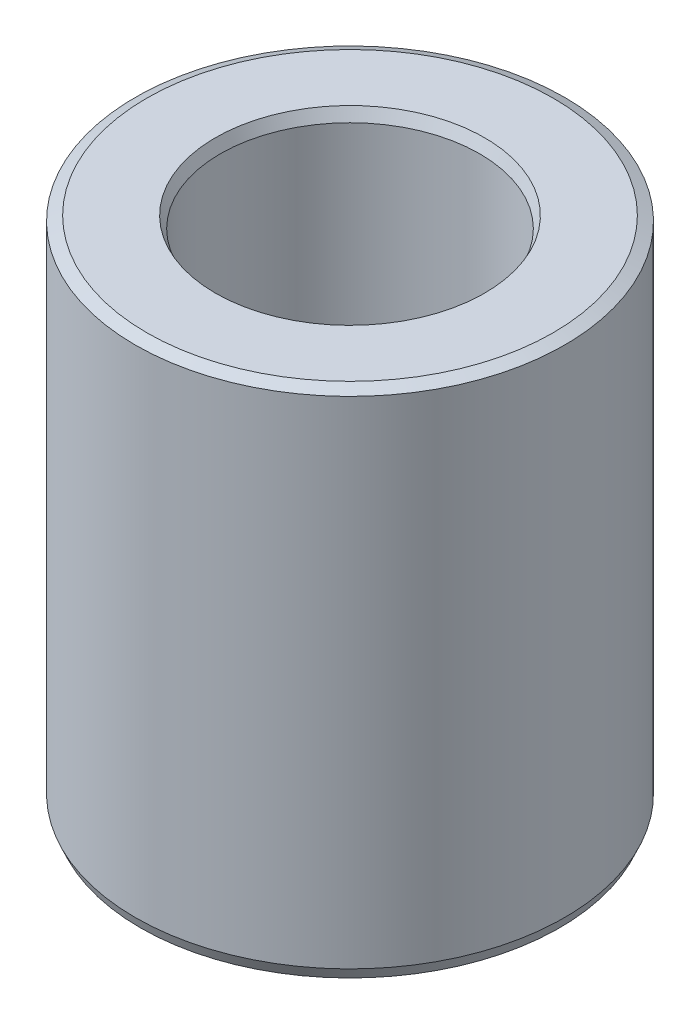
ISO-10303-21;
HEADER;
FILE_DESCRIPTION(('STEP AP214'),'2;1');
FILE_NAME('part.step','',(''),(''),'','','');
FILE_SCHEMA(('AUTOMOTIVE_DESIGN { 1 0 10303 214 1 1 1 1 }'));
ENDSEC;
DATA;
#1=APPLICATION_CONTEXT('core data for automotive mechanical design processes');
#2=APPLICATION_PROTOCOL_DEFINITION('international standard','automotive_design',2000,#1);
#3=PRODUCT_CONTEXT('',#1,'mechanical');
#4=PRODUCT('Part','Part','',(#3));
#5=PRODUCT_RELATED_PRODUCT_CATEGORY('part','',(#4));
#6=PRODUCT_DEFINITION_FORMATION('','',#4);
#7=PRODUCT_DEFINITION_CONTEXT('part definition',#1,'design');
#8=PRODUCT_DEFINITION('design','',#6,#7);
#9=PRODUCT_DEFINITION_SHAPE('','',#8);
#10=(LENGTH_UNIT() NAMED_UNIT(*) SI_UNIT(.MILLI.,.METRE.));
#11=(NAMED_UNIT(*) PLANE_ANGLE_UNIT() SI_UNIT($,.RADIAN.));
#12=(NAMED_UNIT(*) SI_UNIT($,.STERADIAN.) SOLID_ANGLE_UNIT());
#13=UNCERTAINTY_MEASURE_WITH_UNIT(LENGTH_MEASURE(1.E-05),#10,'distance_accuracy_value','');
#14=(GEOMETRIC_REPRESENTATION_CONTEXT(3) GLOBAL_UNCERTAINTY_ASSIGNED_CONTEXT((#13)) GLOBAL_UNIT_ASSIGNED_CONTEXT((#10,
#11,#12)) REPRESENTATION_CONTEXT('',''));
#15=CARTESIAN_POINT('',(0.,0.,0.));
#16=DIRECTION('',(0.,0.,1.));
#17=DIRECTION('',(1.,0.,0.));
#18=AXIS2_PLACEMENT_3D('',#15,#16,#17);
#19=CARTESIAN_POINT('',(0.,35.7987142283722,0.));
#20=DIRECTION('',(0.,-1.,0.));
#21=DIRECTION('',(0.,0.,-1.));
#22=AXIS2_PLACEMENT_3D('',#19,#20,#21);
#23=CYLINDRICAL_SURFACE('',#22,15.);
#24=CARTESIAN_POINT('',(0.,0.796052163354412,0.));
#25=DIRECTION('',(0.,1.,0.));
#26=DIRECTION('',(0.,0.,1.));
#27=AXIS2_PLACEMENT_3D('',#24,#25,#26);
#28=CIRCLE('',#27,15.);
#29=CARTESIAN_POINT('',(0.,0.796052163354412,15.));
#30=VERTEX_POINT('',#29);
#31=EDGE_CURVE('E10',#30,#30,#28,.T.);
#32=ORIENTED_EDGE('',*,*,#31,.T.);
#33=EDGE_LOOP('',(#32));
#34=FACE_BOUND('',#33,.T.);
#35=CARTESIAN_POINT('',(0.,35.4501099124994,0.));
#36=DIRECTION('',(0.,1.,0.));
#37=DIRECTION('',(0.,0.,1.));
#38=AXIS2_PLACEMENT_3D('',#35,#36,#37);
#39=CIRCLE('',#38,15.);
#40=CARTESIAN_POINT('',(0.,35.4501099124994,15.));
#41=VERTEX_POINT('',#40);
#42=EDGE_CURVE('E50',#41,#41,#39,.F.);
#43=ORIENTED_EDGE('',*,*,#42,.T.);
#44=EDGE_LOOP('',(#43));
#45=FACE_BOUND('',#44,.T.);
#46=ADVANCED_FACE('F39',(#34,#45),#23,.T.);
#47=CARTESIAN_POINT('',(0.,35.7987142283722,0.));
#48=DIRECTION('',(0.,1.,0.));
#49=DIRECTION('',(0.,0.,1.));
#50=AXIS2_PLACEMENT_3D('',#47,#48,#49);
#51=PLANE('',#50);
#52=CARTESIAN_POINT('',(0.,35.7987142283722,0.));
#53=DIRECTION('',(0.,1.,0.));
#54=DIRECTION('',(0.,0.,1.));
#55=AXIS2_PLACEMENT_3D('',#52,#53,#54);
#56=CIRCLE('',#55,9.41097797480665);
#57=CARTESIAN_POINT('',(0.,35.7987142283722,9.41097797480665));
#58=VERTEX_POINT('',#57);
#59=EDGE_CURVE('E58',#58,#58,#56,.F.);
#60=ORIENTED_EDGE('',*,*,#59,.T.);
#61=EDGE_LOOP('',(#60));
#62=FACE_BOUND('',#61,.T.);
#63=CARTESIAN_POINT('',(0.,35.7987142283722,0.));
#64=DIRECTION('',(0.,1.,0.));
#65=DIRECTION('',(0.,0.,1.));
#66=AXIS2_PLACEMENT_3D('',#63,#64,#65);
#67=CIRCLE('',#66,14.2039478366456);
#68=CARTESIAN_POINT('',(0.,35.7987142283722,14.2039478366456));
#69=VERTEX_POINT('',#68);
#70=EDGE_CURVE('E61',#69,#69,#67,.T.);
#71=ORIENTED_EDGE('',*,*,#70,.T.);
#72=EDGE_LOOP('',(#71));
#73=FACE_BOUND('',#72,.T.);
#74=ADVANCED_FACE('F88',(#62,#73),#51,.T.);
#75=CARTESIAN_POINT('',(0.,0.,0.));
#76=DIRECTION('',(0.,1.,0.));
#77=DIRECTION('',(0.,0.,1.));
#78=AXIS2_PLACEMENT_3D('',#75,#76,#77);
#79=PLANE('',#78);
#80=CARTESIAN_POINT('',(0.,0.,0.));
#81=DIRECTION('',(0.,1.,0.));
#82=DIRECTION('',(0.,0.,1.));
#83=AXIS2_PLACEMENT_3D('',#80,#81,#82);
#84=CIRCLE('',#83,9.85842582228821);
#85=CARTESIAN_POINT('',(0.,0.,9.85842582228821));
#86=VERTEX_POINT('',#85);
#87=EDGE_CURVE('E51',#86,#86,#84,.T.);
#88=ORIENTED_EDGE('',*,*,#87,.T.);
#89=EDGE_LOOP('',(#88));
#90=FACE_BOUND('',#89,.T.);
#91=CARTESIAN_POINT('',(0.,0.,0.));
#92=DIRECTION('',(0.,1.,0.));
#93=DIRECTION('',(0.,0.,1.));
#94=AXIS2_PLACEMENT_3D('',#91,#92,#93);
#95=CIRCLE('',#94,14.6513956841272);
#96=CARTESIAN_POINT('',(0.,0.,14.6513956841272));
#97=VERTEX_POINT('',#96);
#98=EDGE_CURVE('E54',#97,#97,#95,.F.);
#99=ORIENTED_EDGE('',*,*,#98,.T.);
#100=EDGE_LOOP('',(#99));
#101=FACE_BOUND('',#100,.T.);
#102=ADVANCED_FACE('F83',(#90,#101),#79,.F.);
#103=CARTESIAN_POINT('',(0.,35.7987142283722,0.));
#104=DIRECTION('',(0.,-1.,0.));
#105=DIRECTION('',(0.,0.,-1.));
#106=AXIS2_PLACEMENT_3D('',#103,#104,#105);
#107=CYLINDRICAL_SURFACE('',#106,9.06237365893382);
#108=CARTESIAN_POINT('',(0.,35.0026620650178,0.));
#109=DIRECTION('',(0.,1.,0.));
#110=DIRECTION('',(0.,0.,1.));
#111=AXIS2_PLACEMENT_3D('',#108,#109,#110);
#112=CIRCLE('',#111,9.06237365893382);
#113=CARTESIAN_POINT('',(0.,35.0026620650178,9.06237365893382));
#114=VERTEX_POINT('',#113);
#115=EDGE_CURVE('E67',#114,#114,#112,.T.);
#116=ORIENTED_EDGE('',*,*,#115,.T.);
#117=EDGE_LOOP('',(#116));
#118=FACE_BOUND('',#117,.T.);
#119=CARTESIAN_POINT('',(0.,0.34860431587283,0.));
#120=DIRECTION('',(0.,1.,0.));
#121=DIRECTION('',(0.,0.,1.));
#122=AXIS2_PLACEMENT_3D('',#119,#120,#121);
#123=CIRCLE('',#122,9.06237365893382);
#124=CARTESIAN_POINT('',(0.,0.34860431587283,9.06237365893382));
#125=VERTEX_POINT('',#124);
#126=EDGE_CURVE('E69',#125,#125,#123,.F.);
#127=ORIENTED_EDGE('',*,*,#126,.T.);
#128=EDGE_LOOP('',(#127));
#129=FACE_BOUND('',#128,.T.);
#130=ADVANCED_FACE('F71',(#118,#129),#107,.F.);
#131=CARTESIAN_POINT('',(0.,35.0026620650178,0.));
#132=DIRECTION('',(0.,1.,0.));
#133=DIRECTION('',(0.,0.,1.));
#134=AXIS2_PLACEMENT_3D('',#131,#132,#133);
#135=CONICAL_SURFACE('',#134,9.06237365893382,0.412759910373443);
#136=ORIENTED_EDGE('',*,*,#59,.F.);
#137=EDGE_LOOP('',(#136));
#138=FACE_BOUND('',#137,.T.);
#139=ORIENTED_EDGE('',*,*,#115,.F.);
#140=EDGE_LOOP('',(#139));
#141=FACE_BOUND('',#140,.T.);
#142=ADVANCED_FACE('F77',(#138,#141),#135,.F.);
#143=CARTESIAN_POINT('',(0.,0.,0.));
#144=DIRECTION('',(0.,-1.,0.));
#145=DIRECTION('',(0.,0.,-1.));
#146=AXIS2_PLACEMENT_3D('',#143,#144,#145);
#147=CONICAL_SURFACE('',#146,9.85842582228821,1.15803641642144);
#148=ORIENTED_EDGE('',*,*,#126,.F.);
#149=EDGE_LOOP('',(#148));
#150=FACE_BOUND('',#149,.T.);
#151=ORIENTED_EDGE('',*,*,#87,.F.);
#152=EDGE_LOOP('',(#151));
#153=FACE_BOUND('',#152,.T.);
#154=ADVANCED_FACE('F73',(#150,#153),#147,.F.);
#155=CARTESIAN_POINT('',(0.,0.796052163354412,0.));
#156=DIRECTION('',(0.,1.,0.));
#157=DIRECTION('',(0.,0.,1.));
#158=AXIS2_PLACEMENT_3D('',#155,#156,#157);
#159=CONICAL_SURFACE('',#158,15.,0.412759910373455);
#160=CARTESIAN_POINT('',(0.,0.,14.6513956841272));
#161=CARTESIAN_POINT('',(0.,0.00829221003494138,14.6550269790842));
#162=CARTESIAN_POINT('',(0.,0.0165844200698833,14.6586582740412));
#163=CARTESIAN_POINT('',(0.,0.033168840139767,14.6659208639552));
#164=CARTESIAN_POINT('',(0.,0.0414610501747089,14.6695521589122));
#165=CARTESIAN_POINT('',(0.,0.0580454702445925,14.6768147488262));
#166=CARTESIAN_POINT('',(0.,0.0663376802795343,14.6804460437832));
#167=CARTESIAN_POINT('',(0.,0.0829221003494177,14.6877086336972));
#168=CARTESIAN_POINT('',(0.,0.0912143103843594,14.6913399286543));
#169=CARTESIAN_POINT('',(0.,0.107798730454243,14.6986025185683));
#170=CARTESIAN_POINT('',(0.,0.116090940489185,14.7022338135253));
#171=CARTESIAN_POINT('',(0.,0.132675360559069,14.7094964034393));
#172=CARTESIAN_POINT('',(0.,0.14096757059401,14.7131276983963));
#173=CARTESIAN_POINT('',(0.,0.157551990663894,14.7203902883103));
#174=CARTESIAN_POINT('',(0.,0.165844200698836,14.7240215832673));
#175=CARTESIAN_POINT('',(0.,0.182428620768719,14.7312841731814));
#176=CARTESIAN_POINT('',(0.,0.190720830803661,14.7349154681384));
#177=CARTESIAN_POINT('',(0.,0.207305250873545,14.7421780580524));
#178=CARTESIAN_POINT('',(0.,0.215597460908486,14.7458093530094));
#179=CARTESIAN_POINT('',(0.,0.23218188097837,14.7530719429234));
#180=CARTESIAN_POINT('',(0.,0.240474091013312,14.7567032378804));
#181=CARTESIAN_POINT('',(0.,0.257058511083195,14.7639658277944));
#182=CARTESIAN_POINT('',(0.,0.265350721118137,14.7675971227514));
#183=CARTESIAN_POINT('',(0.,0.281935141188021,14.7748597126655));
#184=CARTESIAN_POINT('',(0.,0.290227351222963,14.7784910076225));
#185=CARTESIAN_POINT('',(0.,0.306811771292846,14.7857535975365));
#186=CARTESIAN_POINT('',(0.,0.315103981327788,14.7893848924935));
#187=CARTESIAN_POINT('',(0.,0.331688401397671,14.7966474824075));
#188=CARTESIAN_POINT('',(0.,0.339980611432613,14.8002787773645));
#189=CARTESIAN_POINT('',(0.,0.356565031502497,14.8075413672785));
#190=CARTESIAN_POINT('',(0.,0.364857241537439,14.8111726622355));
#191=CARTESIAN_POINT('',(0.,0.381441661607322,14.8184352521496));
#192=CARTESIAN_POINT('',(0.,0.389733871642264,14.8220665471066));
#193=CARTESIAN_POINT('',(0.,0.406318291712148,14.8293291370206));
#194=CARTESIAN_POINT('',(0.,0.41461050174709,14.8329604319776));
#195=CARTESIAN_POINT('',(0.,0.431194921816973,14.8402230218916));
#196=CARTESIAN_POINT('',(0.,0.439487131851915,14.8438543168486));
#197=CARTESIAN_POINT('',(0.,0.456071551921798,14.8511169067626));
#198=CARTESIAN_POINT('',(0.,0.46436376195674,14.8547482017196));
#199=CARTESIAN_POINT('',(0.,0.480948182026624,14.8620107916337));
#200=CARTESIAN_POINT('',(0.,0.489240392061566,14.8656420865907));
#201=CARTESIAN_POINT('',(0.,0.505824812131449,14.8729046765047));
#202=CARTESIAN_POINT('',(0.,0.514117022166391,14.8765359714617));
#203=CARTESIAN_POINT('',(0.,0.530701442236274,14.8837985613757));
#204=CARTESIAN_POINT('',(0.,0.538993652271216,14.8874298563327));
#205=CARTESIAN_POINT('',(0.,0.5555780723411,14.8946924462467));
#206=CARTESIAN_POINT('',(0.,0.563870282376042,14.8983237412038));
#207=CARTESIAN_POINT('',(0.,0.580454702445925,14.9055863311178));
#208=CARTESIAN_POINT('',(0.,0.588746912480867,14.9092176260748));
#209=CARTESIAN_POINT('',(0.,0.605331332550751,14.9164802159888));
#210=CARTESIAN_POINT('',(0.,0.613623542585693,14.9201115109458));
#211=CARTESIAN_POINT('',(0.,0.630207962655576,14.9273741008598));
#212=CARTESIAN_POINT('',(0.,0.638500172690518,14.9310053958168));
#213=CARTESIAN_POINT('',(0.,0.655084592760401,14.9382679857309));
#214=CARTESIAN_POINT('',(0.,0.663376802795343,14.9418992806879));
#215=CARTESIAN_POINT('',(0.,0.679961222865227,14.9491618706019));
#216=CARTESIAN_POINT('',(0.,0.688253432900169,14.9527931655589));
#217=CARTESIAN_POINT('',(0.,0.704837852970052,14.9600557554729));
#218=CARTESIAN_POINT('',(0.,0.713130063004994,14.9636870504299));
#219=CARTESIAN_POINT('',(0.,0.729714483074877,14.9709496403439));
#220=CARTESIAN_POINT('',(0.,0.738006693109819,14.9745809353009));
#221=CARTESIAN_POINT('',(0.,0.754591113179703,14.981843525215));
#222=CARTESIAN_POINT('',(0.,0.762883323214645,14.985474820172));
#223=CARTESIAN_POINT('',(0.,0.779467743284529,14.992737410086));
#224=CARTESIAN_POINT('',(0.,0.78775995331947,14.996368705043));
#225=CARTESIAN_POINT('',(0.,0.796052163354412,15.));
#226=B_SPLINE_CURVE_WITH_KNOTS('',3,(#160,#161,#162,#163,#164,#165,#166,#167,#168,#169,#170,
#171,#172,#173,#174,#175,#176,#177,#178,#179,#180,#181,#182,#183,#184,#185,#186,#187,#188,#189,
#190,#191,#192,#193,#194,#195,#196,#197,#198,#199,#200,#201,#202,#203,#204,#205,#206,#207,#208,
#209,#210,#211,#212,#213,#214,#215,#216,#217,#218,#219,#220,#221,#222,#223,#224,#225),
.UNSPECIFIED.,.F.,.F.,(4,2,2,2,2,2,2,2,2,2,2,2,2,2,2,2,2,2,2,2,2,2,2,2,2,2,2,2,2,2,2,2,4),(0.,
0.0271573830284785,0.0543147660569563,0.0814721490854347,0.108629532113913,0.135786915142391,
0.162944298170869,0.190101681199348,0.217259064227826,0.244416447256304,0.271573830284783,
0.298731213313261,0.325888596341739,0.353045979370218,0.380203362398695,0.407360745427174,
0.434518128455652,0.46167551148413,0.488832894512609,0.515990277541086,0.543147660569565,
0.570305043598043,0.597462426626521,0.624619809654999,0.651777192683478,0.678934575711956,
0.706091958740434,0.733249341768913,0.76040672479739,0.787564107825869,0.814721490854347,
0.841878873882825,0.869036256911304),.UNSPECIFIED.);
#227=EDGE_CURVE('BSEAM76',#97,#30,#226,.T.);
#228=ORIENTED_EDGE('',*,*,#98,.F.);
#229=ORIENTED_EDGE('',*,*,#31,.F.);
#230=ORIENTED_EDGE('',*,*,#227,.T.);
#231=ORIENTED_EDGE('',*,*,#227,.F.);
#232=EDGE_LOOP('',(#228,#230,#229,#231));
#233=FACE_BOUND('',#232,.T.);
#234=ADVANCED_FACE('F76',(#233),#159,.T.);
#235=CARTESIAN_POINT('',(0.,35.7987142283722,0.));
#236=DIRECTION('',(0.,-1.,0.));
#237=DIRECTION('',(0.,0.,-1.));
#238=AXIS2_PLACEMENT_3D('',#235,#236,#237);
#239=CONICAL_SURFACE('',#238,14.2039478366456,1.15803641642144);
#240=ORIENTED_EDGE('',*,*,#42,.F.);
#241=EDGE_LOOP('',(#240));
#242=FACE_BOUND('',#241,.T.);
#243=ORIENTED_EDGE('',*,*,#70,.F.);
#244=EDGE_LOOP('',(#243));
#245=FACE_BOUND('',#244,.T.);
#246=ADVANCED_FACE('F45',(#242,#245),#239,.T.);
#247=CLOSED_SHELL('',(#46,#74,#102,#130,#142,#154,#234,#246));
#248=MANIFOLD_SOLID_BREP('B2',#247);
#249=ADVANCED_BREP_SHAPE_REPRESENTATION('',(#18,#248),#14);
#250=SHAPE_DEFINITION_REPRESENTATION(#9,#249);
ENDSEC;
END-ISO-10303-21;
